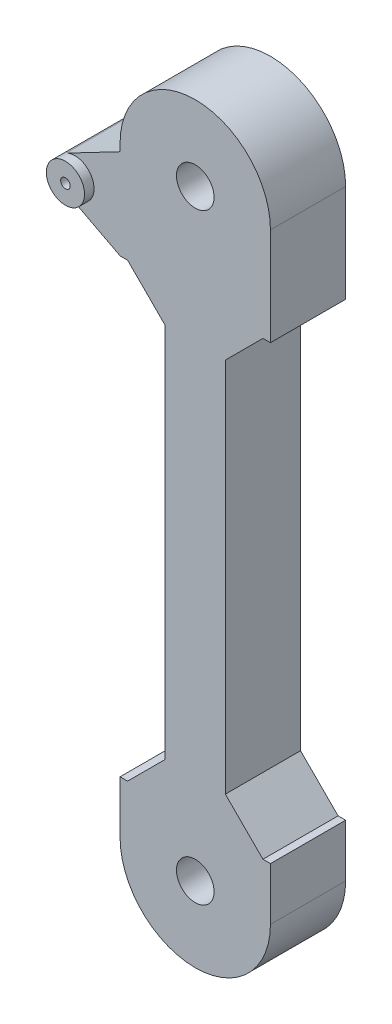
ISO-10303-21;
HEADER;
FILE_DESCRIPTION(('STEP AP214'),'2;1');
FILE_NAME('part.step','',(''),(''),'','','');
FILE_SCHEMA(('AUTOMOTIVE_DESIGN { 1 0 10303 214 1 1 1 1 }'));
ENDSEC;
DATA;
#1=APPLICATION_CONTEXT('core data for automotive mechanical design processes');
#2=APPLICATION_PROTOCOL_DEFINITION('international standard','automotive_design',2000,#1);
#3=PRODUCT_CONTEXT('',#1,'mechanical');
#4=PRODUCT('Part','Part','',(#3));
#5=PRODUCT_RELATED_PRODUCT_CATEGORY('part','',(#4));
#6=PRODUCT_DEFINITION_FORMATION('','',#4);
#7=PRODUCT_DEFINITION_CONTEXT('part definition',#1,'design');
#8=PRODUCT_DEFINITION('design','',#6,#7);
#9=PRODUCT_DEFINITION_SHAPE('','',#8);
#10=(LENGTH_UNIT() NAMED_UNIT(*) SI_UNIT(.MILLI.,.METRE.));
#11=(NAMED_UNIT(*) PLANE_ANGLE_UNIT() SI_UNIT($,.RADIAN.));
#12=(NAMED_UNIT(*) SI_UNIT($,.STERADIAN.) SOLID_ANGLE_UNIT());
#13=UNCERTAINTY_MEASURE_WITH_UNIT(LENGTH_MEASURE(1.E-05),#10,'distance_accuracy_value','');
#14=(GEOMETRIC_REPRESENTATION_CONTEXT(3) GLOBAL_UNCERTAINTY_ASSIGNED_CONTEXT((#13)) GLOBAL_UNIT_ASSIGNED_CONTEXT((#10,
#11,#12)) REPRESENTATION_CONTEXT('',''));
#15=CARTESIAN_POINT('',(0.,0.,0.));
#16=DIRECTION('',(0.,0.,1.));
#17=DIRECTION('',(1.,0.,0.));
#18=AXIS2_PLACEMENT_3D('',#15,#16,#17);
#19=CARTESIAN_POINT('',(10.,0.,10.));
#20=DIRECTION('',(-1.,0.,0.));
#21=DIRECTION('',(0.,-1.,0.));
#22=AXIS2_PLACEMENT_3D('',#19,#20,#21);
#23=PLANE('',#22);
#24=DIRECTION('',(0.,1.,0.));
#25=VECTOR('',#24,1.);
#26=CARTESIAN_POINT('',(10.,0.,0.));
#27=LINE('',#26,#25);
#28=CARTESIAN_POINT('',(10.,0.,0.));
#29=VERTEX_POINT('',#28);
#30=CARTESIAN_POINT('',(9.99999999999999,7.00000000000001,0.));
#31=VERTEX_POINT('',#30);
#32=EDGE_CURVE('E220',#29,#31,#27,.T.);
#33=ORIENTED_EDGE('',*,*,#32,.T.);
#34=DIRECTION('',(0.,0.,1.));
#35=VECTOR('',#34,1.);
#36=CARTESIAN_POINT('',(9.99999999999999,7.00000000000001,0.));
#37=LINE('',#36,#35);
#38=CARTESIAN_POINT('',(9.99999999999999,7.00000000000001,10.));
#39=VERTEX_POINT('',#38);
#40=EDGE_CURVE('E488',#31,#39,#37,.T.);
#41=ORIENTED_EDGE('',*,*,#40,.T.);
#42=DIRECTION('',(0.,1.,0.));
#43=VECTOR('',#42,1.);
#44=CARTESIAN_POINT('',(10.,0.,10.));
#45=LINE('',#44,#43);
#46=CARTESIAN_POINT('',(10.,0.,10.));
#47=VERTEX_POINT('',#46);
#48=EDGE_CURVE('E230',#47,#39,#45,.T.);
#49=ORIENTED_EDGE('',*,*,#48,.F.);
#50=DIRECTION('',(0.,0.,-1.));
#51=VECTOR('',#50,1.);
#52=CARTESIAN_POINT('',(10.,0.,10.));
#53=LINE('',#52,#51);
#54=EDGE_CURVE('E229',#47,#29,#53,.T.);
#55=ORIENTED_EDGE('',*,*,#54,.T.);
#56=EDGE_LOOP('',(#33,#41,#49,#55));
#57=FACE_BOUND('',#56,.T.);
#58=ADVANCED_FACE('F45',(#57),#23,.F.);
#59=CARTESIAN_POINT('',(-10.,80.,10.));
#60=DIRECTION('',(1.,0.,0.));
#61=DIRECTION('',(0.,1.,0.));
#62=AXIS2_PLACEMENT_3D('',#59,#60,#61);
#63=PLANE('',#62);
#64=DIRECTION('',(0.,-1.,0.));
#65=VECTOR('',#64,1.);
#66=CARTESIAN_POINT('',(-10.,80.,10.));
#67=LINE('',#66,#65);
#68=CARTESIAN_POINT('',(-9.99999999999999,7.00000000000001,10.));
#69=VERTEX_POINT('',#68);
#70=CARTESIAN_POINT('',(-10.,0.,10.));
#71=VERTEX_POINT('',#70);
#72=EDGE_CURVE('E197',#69,#71,#67,.T.);
#73=ORIENTED_EDGE('',*,*,#72,.F.);
#74=DIRECTION('',(0.,0.,1.));
#75=VECTOR('',#74,1.);
#76=CARTESIAN_POINT('',(-9.99999999999999,7.00000000000001,0.));
#77=LINE('',#76,#75);
#78=CARTESIAN_POINT('',(-9.99999999999999,7.00000000000001,0.));
#79=VERTEX_POINT('',#78);
#80=EDGE_CURVE('E180',#79,#69,#77,.T.);
#81=ORIENTED_EDGE('',*,*,#80,.F.);
#82=DIRECTION('',(0.,-1.,0.));
#83=VECTOR('',#82,1.);
#84=CARTESIAN_POINT('',(-10.,80.,0.));
#85=LINE('',#84,#83);
#86=CARTESIAN_POINT('',(-10.,0.,0.));
#87=VERTEX_POINT('',#86);
#88=EDGE_CURVE('E195',#79,#87,#85,.T.);
#89=ORIENTED_EDGE('',*,*,#88,.T.);
#90=DIRECTION('',(0.,0.,-1.));
#91=VECTOR('',#90,1.);
#92=CARTESIAN_POINT('',(-10.,0.,10.));
#93=LINE('',#92,#91);
#94=EDGE_CURVE('E234',#71,#87,#93,.T.);
#95=ORIENTED_EDGE('',*,*,#94,.F.);
#96=EDGE_LOOP('',(#73,#81,#89,#95));
#97=FACE_BOUND('',#96,.T.);
#98=ADVANCED_FACE('F193',(#97),#63,.F.);
#99=CARTESIAN_POINT('',(0.,80.,10.));
#100=DIRECTION('',(0.,0.,-1.));
#101=DIRECTION('',(-1.,0.,0.));
#102=AXIS2_PLACEMENT_3D('',#99,#100,#101);
#103=CYLINDRICAL_SURFACE('',#102,10.);
#104=CARTESIAN_POINT('',(0.,80.,0.));
#105=DIRECTION('',(0.,0.,1.));
#106=DIRECTION('',(1.,0.,0.));
#107=AXIS2_PLACEMENT_3D('',#104,#105,#106);
#108=CIRCLE('',#107,10.);
#109=CARTESIAN_POINT('',(10.,80.,0.));
#110=VERTEX_POINT('',#109);
#111=CARTESIAN_POINT('',(-10.,80.,0.));
#112=VERTEX_POINT('',#111);
#113=EDGE_CURVE('E208',#110,#112,#108,.T.);
#114=ORIENTED_EDGE('',*,*,#113,.T.);
#115=DIRECTION('',(0.,0.,-1.));
#116=VECTOR('',#115,1.);
#117=CARTESIAN_POINT('',(-10.,80.,10.));
#118=LINE('',#117,#116);
#119=CARTESIAN_POINT('',(-10.,80.,10.));
#120=VERTEX_POINT('',#119);
#121=EDGE_CURVE('E237',#120,#112,#118,.T.);
#122=ORIENTED_EDGE('',*,*,#121,.F.);
#123=CARTESIAN_POINT('',(0.,80.,10.));
#124=DIRECTION('',(0.,0.,1.));
#125=DIRECTION('',(1.,0.,0.));
#126=AXIS2_PLACEMENT_3D('',#123,#124,#125);
#127=CIRCLE('',#126,10.);
#128=CARTESIAN_POINT('',(10.,80.,10.));
#129=VERTEX_POINT('',#128);
#130=EDGE_CURVE('E224',#129,#120,#127,.T.);
#131=ORIENTED_EDGE('',*,*,#130,.F.);
#132=DIRECTION('',(0.,0.,-1.));
#133=VECTOR('',#132,1.);
#134=CARTESIAN_POINT('',(10.,80.,10.));
#135=LINE('',#134,#133);
#136=EDGE_CURVE('E225',#129,#110,#135,.T.);
#137=ORIENTED_EDGE('',*,*,#136,.T.);
#138=EDGE_LOOP('',(#114,#122,#131,#137));
#139=FACE_BOUND('',#138,.T.);
#140=ADVANCED_FACE('F315',(#139),#103,.T.);
#141=CARTESIAN_POINT('',(-10.,79.,0.));
#142=VERTEX_POINT('',#141);
#143=EDGE_CURVE('E207',#112,#142,#85,.T.);
#144=ORIENTED_EDGE('',*,*,#143,.T.);
#145=DIRECTION('',(0.,0.,1.));
#146=VECTOR('',#145,1.);
#147=CARTESIAN_POINT('',(-10.,79.,0.));
#148=LINE('',#147,#146);
#149=CARTESIAN_POINT('',(-10.,79.,10.));
#150=VERTEX_POINT('',#149);
#151=EDGE_CURVE('E324',#142,#150,#148,.T.);
#152=ORIENTED_EDGE('',*,*,#151,.T.);
#153=EDGE_CURVE('E296',#120,#150,#67,.T.);
#154=ORIENTED_EDGE('',*,*,#153,.F.);
#155=ORIENTED_EDGE('',*,*,#121,.T.);
#156=EDGE_LOOP('',(#144,#152,#154,#155));
#157=FACE_BOUND('',#156,.T.);
#158=ADVANCED_FACE('F323',(#157),#63,.F.);
#159=CARTESIAN_POINT('',(0.,0.,10.));
#160=DIRECTION('',(0.,0.,-1.));
#161=DIRECTION('',(-1.,0.,0.));
#162=AXIS2_PLACEMENT_3D('',#159,#160,#161);
#163=CYLINDRICAL_SURFACE('',#162,10.);
#164=CARTESIAN_POINT('',(0.,0.,0.));
#165=DIRECTION('',(0.,0.,1.));
#166=DIRECTION('',(1.,0.,0.));
#167=AXIS2_PLACEMENT_3D('',#164,#165,#166);
#168=CIRCLE('',#167,10.);
#169=EDGE_CURVE('E205',#87,#29,#168,.T.);
#170=ORIENTED_EDGE('',*,*,#169,.T.);
#171=ORIENTED_EDGE('',*,*,#54,.F.);
#172=CARTESIAN_POINT('',(0.,0.,10.));
#173=DIRECTION('',(0.,0.,1.));
#174=DIRECTION('',(1.,0.,0.));
#175=AXIS2_PLACEMENT_3D('',#172,#173,#174);
#176=CIRCLE('',#175,10.);
#177=EDGE_CURVE('E294',#71,#47,#176,.T.);
#178=ORIENTED_EDGE('',*,*,#177,.F.);
#179=ORIENTED_EDGE('',*,*,#94,.T.);
#180=EDGE_LOOP('',(#170,#171,#178,#179));
#181=FACE_BOUND('',#180,.T.);
#182=ADVANCED_FACE('F427',(#181),#163,.T.);
#183=CARTESIAN_POINT('',(10.,67.,10.));
#184=VERTEX_POINT('',#183);
#185=EDGE_CURVE('E292',#184,#129,#45,.T.);
#186=ORIENTED_EDGE('',*,*,#185,.F.);
#187=DIRECTION('',(0.,0.,1.));
#188=VECTOR('',#187,1.);
#189=CARTESIAN_POINT('',(10.,67.,0.));
#190=LINE('',#189,#188);
#191=CARTESIAN_POINT('',(10.,67.,0.));
#192=VERTEX_POINT('',#191);
#193=EDGE_CURVE('E312',#192,#184,#190,.T.);
#194=ORIENTED_EDGE('',*,*,#193,.F.);
#195=EDGE_CURVE('E219',#192,#110,#27,.T.);
#196=ORIENTED_EDGE('',*,*,#195,.T.);
#197=ORIENTED_EDGE('',*,*,#136,.F.);
#198=EDGE_LOOP('',(#186,#194,#196,#197));
#199=FACE_BOUND('',#198,.T.);
#200=ADVANCED_FACE('F310',(#199),#23,.F.);
#201=CARTESIAN_POINT('',(0.,80.,10.));
#202=DIRECTION('',(0.,0.,1.));
#203=DIRECTION('',(1.,0.,0.));
#204=AXIS2_PLACEMENT_3D('',#201,#202,#203);
#205=PLANE('',#204);
#206=DIRECTION('',(-1.,0.,0.));
#207=VECTOR('',#206,1.);
#208=CARTESIAN_POINT('',(-10.,67.,10.));
#209=LINE('',#208,#207);
#210=CARTESIAN_POINT('',(-9.00000000000006,67.,10.));
#211=VERTEX_POINT('',#210);
#212=CARTESIAN_POINT('',(-10.,67.,10.));
#213=VERTEX_POINT('',#212);
#214=EDGE_CURVE('E189',#211,#213,#209,.T.);
#215=ORIENTED_EDGE('',*,*,#214,.F.);
#216=DIRECTION('',(-0.707106781186552,0.707106781186543,0.));
#217=VECTOR('',#216,1.);
#218=CARTESIAN_POINT('',(-9.00000000000006,67.,10.));
#219=LINE('',#218,#217);
#220=CARTESIAN_POINT('',(-4.,62.,10.));
#221=VERTEX_POINT('',#220);
#222=EDGE_CURVE('E280',#211,#221,#219,.F.);
#223=ORIENTED_EDGE('',*,*,#222,.T.);
#224=DIRECTION('',(0.,1.,0.));
#225=VECTOR('',#224,1.);
#226=CARTESIAN_POINT('',(-4.,67.,10.));
#227=LINE('',#226,#225);
#228=CARTESIAN_POINT('',(-4.,12.,10.));
#229=VERTEX_POINT('',#228);
#230=EDGE_CURVE('E336',#229,#221,#227,.T.);
#231=ORIENTED_EDGE('',*,*,#230,.F.);
#232=DIRECTION('',(0.707106781186544,0.707106781186552,0.));
#233=VECTOR('',#232,1.);
#234=CARTESIAN_POINT('',(-4.,12.,10.));
#235=LINE('',#234,#233);
#236=CARTESIAN_POINT('',(-8.99999999999996,7.00000000000001,10.));
#237=VERTEX_POINT('',#236);
#238=EDGE_CURVE('E274',#229,#237,#235,.F.);
#239=ORIENTED_EDGE('',*,*,#238,.T.);
#240=DIRECTION('',(1.,0.,0.));
#241=VECTOR('',#240,1.);
#242=CARTESIAN_POINT('',(-9.99999999999999,7.00000000000001,10.));
#243=LINE('',#242,#241);
#244=EDGE_CURVE('E331',#69,#237,#243,.T.);
#245=ORIENTED_EDGE('',*,*,#244,.F.);
#246=ORIENTED_EDGE('',*,*,#72,.T.);
#247=ORIENTED_EDGE('',*,*,#177,.T.);
#248=ORIENTED_EDGE('',*,*,#48,.T.);
#249=DIRECTION('',(1.,0.,0.));
#250=VECTOR('',#249,1.);
#251=CARTESIAN_POINT('',(9.99999999999999,7.00000000000001,10.));
#252=LINE('',#251,#250);
#253=CARTESIAN_POINT('',(9.00000000000003,7.00000000000001,10.));
#254=VERTEX_POINT('',#253);
#255=EDGE_CURVE('E339',#254,#39,#252,.T.);
#256=ORIENTED_EDGE('',*,*,#255,.F.);
#257=DIRECTION('',(0.707106781186551,-0.707106781186544,0.));
#258=VECTOR('',#257,1.);
#259=CARTESIAN_POINT('',(9.00000000000003,7.00000000000001,10.));
#260=LINE('',#259,#258);
#261=CARTESIAN_POINT('',(4.,12.,10.));
#262=VERTEX_POINT('',#261);
#263=EDGE_CURVE('E268',#254,#262,#260,.F.);
#264=ORIENTED_EDGE('',*,*,#263,.T.);
#265=DIRECTION('',(0.,-1.,0.));
#266=VECTOR('',#265,1.);
#267=CARTESIAN_POINT('',(4.,67.,10.));
#268=LINE('',#267,#266);
#269=CARTESIAN_POINT('',(4.,61.9999999999999,10.));
#270=VERTEX_POINT('',#269);
#271=EDGE_CURVE('E332',#270,#262,#268,.T.);
#272=ORIENTED_EDGE('',*,*,#271,.F.);
#273=DIRECTION('',(-0.707106781186544,-0.707106781186551,0.));
#274=VECTOR('',#273,1.);
#275=CARTESIAN_POINT('',(4.,61.9999999999999,10.));
#276=LINE('',#275,#274);
#277=CARTESIAN_POINT('',(9.00000000000001,67.,10.));
#278=VERTEX_POINT('',#277);
#279=EDGE_CURVE('E55',#270,#278,#276,.F.);
#280=ORIENTED_EDGE('',*,*,#279,.T.);
#281=DIRECTION('',(-1.,0.,0.));
#282=VECTOR('',#281,1.);
#283=CARTESIAN_POINT('',(10.,67.,10.));
#284=LINE('',#283,#282);
#285=EDGE_CURVE('E329',#184,#278,#284,.T.);
#286=ORIENTED_EDGE('',*,*,#285,.F.);
#287=ORIENTED_EDGE('',*,*,#185,.T.);
#288=ORIENTED_EDGE('',*,*,#130,.T.);
#289=ORIENTED_EDGE('',*,*,#153,.T.);
#290=DIRECTION('',(-0.886349719827352,-0.463016386494014,0.));
#291=VECTOR('',#290,1.);
#292=CARTESIAN_POINT('',(-10.,79.,10.));
#293=LINE('',#292,#291);
#294=CARTESIAN_POINT('',(-17.1760616216948,75.2513282883615,10.));
#295=VERTEX_POINT('',#294);
#296=EDGE_CURVE('E364',#150,#295,#293,.T.);
#297=ORIENTED_EDGE('',*,*,#296,.T.);
#298=CARTESIAN_POINT('',(-16.,73.,10.));
#299=DIRECTION('',(0.,0.,1.));
#300=DIRECTION('',(1.,0.,0.));
#301=AXIS2_PLACEMENT_3D('',#298,#299,#300);
#302=CIRCLE('',#301,2.54);
#303=CARTESIAN_POINT('',(-17.1760616216954,70.7486717116388,10.));
#304=VERTEX_POINT('',#303);
#305=EDGE_CURVE('E241',#304,#295,#302,.T.);
#306=ORIENTED_EDGE('',*,*,#305,.F.);
#307=DIRECTION('',(0.886349719827354,-0.463016386494011,0.));
#308=VECTOR('',#307,1.);
#309=CARTESIAN_POINT('',(-17.1760616216954,70.7486717116388,10.));
#310=LINE('',#309,#308);
#311=EDGE_CURVE('E368',#304,#213,#310,.T.);
#312=ORIENTED_EDGE('',*,*,#311,.T.);
#313=EDGE_LOOP('',(#215,#223,#231,#239,#245,#246,#247,#248,#256,#264,#272,#280,#286,#287,#288,
#289,#297,#306,#312));
#314=FACE_BOUND('',#313,.T.);
#315=CARTESIAN_POINT('',(0.,0.,10.));
#316=DIRECTION('',(0.,0.,1.));
#317=DIRECTION('',(1.,0.,0.));
#318=AXIS2_PLACEMENT_3D('',#315,#316,#317);
#319=CIRCLE('',#318,2.5);
#320=CARTESIAN_POINT('',(2.5,0.,10.));
#321=VERTEX_POINT('',#320);
#322=EDGE_CURVE('E399',#321,#321,#319,.T.);
#323=ORIENTED_EDGE('',*,*,#322,.F.);
#324=EDGE_LOOP('',(#323));
#325=FACE_BOUND('',#324,.T.);
#326=CARTESIAN_POINT('',(0.,80.,10.));
#327=DIRECTION('',(0.,0.,1.));
#328=DIRECTION('',(1.,0.,0.));
#329=AXIS2_PLACEMENT_3D('',#326,#327,#328);
#330=CIRCLE('',#329,2.5);
#331=CARTESIAN_POINT('',(2.5,80.,10.));
#332=VERTEX_POINT('',#331);
#333=EDGE_CURVE('E403',#332,#332,#330,.T.);
#334=ORIENTED_EDGE('',*,*,#333,.F.);
#335=EDGE_LOOP('',(#334));
#336=FACE_BOUND('',#335,.T.);
#337=ADVANCED_FACE('F327',(#314,#325,#336),#205,.T.);
#338=CARTESIAN_POINT('',(0.,80.,0.));
#339=DIRECTION('',(0.,0.,1.));
#340=DIRECTION('',(1.,0.,0.));
#341=AXIS2_PLACEMENT_3D('',#338,#339,#340);
#342=PLANE('',#341);
#343=CARTESIAN_POINT('',(-16.,73.,0.));
#344=DIRECTION('',(0.,0.,1.));
#345=DIRECTION('',(1.,0.,0.));
#346=AXIS2_PLACEMENT_3D('',#343,#344,#345);
#347=CIRCLE('',#346,0.635000000000003);
#348=CARTESIAN_POINT('',(-15.365,73.,0.));
#349=VERTEX_POINT('',#348);
#350=EDGE_CURVE('E359',#349,#349,#347,.T.);
#351=ORIENTED_EDGE('',*,*,#350,.T.);
#352=EDGE_LOOP('',(#351));
#353=FACE_BOUND('',#352,.T.);
#354=CARTESIAN_POINT('',(0.,0.,0.));
#355=DIRECTION('',(0.,0.,1.));
#356=DIRECTION('',(1.,0.,0.));
#357=AXIS2_PLACEMENT_3D('',#354,#355,#356);
#358=CIRCLE('',#357,2.5);
#359=CARTESIAN_POINT('',(2.5,0.,0.));
#360=VERTEX_POINT('',#359);
#361=EDGE_CURVE('E213',#360,#360,#358,.T.);
#362=ORIENTED_EDGE('',*,*,#361,.T.);
#363=EDGE_LOOP('',(#362));
#364=FACE_BOUND('',#363,.T.);
#365=CARTESIAN_POINT('',(0.,80.,0.));
#366=DIRECTION('',(0.,0.,1.));
#367=DIRECTION('',(1.,0.,0.));
#368=AXIS2_PLACEMENT_3D('',#365,#366,#367);
#369=CIRCLE('',#368,2.5);
#370=CARTESIAN_POINT('',(2.5,80.,0.));
#371=VERTEX_POINT('',#370);
#372=EDGE_CURVE('E385',#371,#371,#369,.T.);
#373=ORIENTED_EDGE('',*,*,#372,.T.);
#374=EDGE_LOOP('',(#373));
#375=FACE_BOUND('',#374,.T.);
#376=DIRECTION('',(1.,0.,0.));
#377=VECTOR('',#376,1.);
#378=CARTESIAN_POINT('',(-9.99999999999999,7.00000000000001,0.));
#379=LINE('',#378,#377);
#380=CARTESIAN_POINT('',(-8.99999999999996,7.00000000000001,0.));
#381=VERTEX_POINT('',#380);
#382=EDGE_CURVE('E176',#79,#381,#379,.T.);
#383=ORIENTED_EDGE('',*,*,#382,.T.);
#384=DIRECTION('',(-0.707106781186544,-0.707106781186552,0.));
#385=VECTOR('',#384,1.);
#386=CARTESIAN_POINT('',(32.,48.0000000000004,0.));
#387=LINE('',#386,#385);
#388=CARTESIAN_POINT('',(-4.,12.,0.));
#389=VERTEX_POINT('',#388);
#390=EDGE_CURVE('E277',#381,#389,#387,.F.);
#391=ORIENTED_EDGE('',*,*,#390,.T.);
#392=DIRECTION('',(0.,1.,0.));
#393=VECTOR('',#392,1.);
#394=CARTESIAN_POINT('',(-4.,67.,0.));
#395=LINE('',#394,#393);
#396=CARTESIAN_POINT('',(-4.,62.,0.));
#397=VERTEX_POINT('',#396);
#398=EDGE_CURVE('E188',#389,#397,#395,.T.);
#399=ORIENTED_EDGE('',*,*,#398,.T.);
#400=DIRECTION('',(0.707106781186552,-0.707106781186543,0.));
#401=VECTOR('',#400,1.);
#402=CARTESIAN_POINT('',(-11.,68.9999999999999,0.));
#403=LINE('',#402,#401);
#404=CARTESIAN_POINT('',(-9.00000000000006,67.,0.));
#405=VERTEX_POINT('',#404);
#406=EDGE_CURVE('E283',#397,#405,#403,.F.);
#407=ORIENTED_EDGE('',*,*,#406,.T.);
#408=DIRECTION('',(-1.,0.,0.));
#409=VECTOR('',#408,1.);
#410=CARTESIAN_POINT('',(-10.,67.,0.));
#411=LINE('',#410,#409);
#412=CARTESIAN_POINT('',(-10.,67.,0.));
#413=VERTEX_POINT('',#412);
#414=EDGE_CURVE('E200',#405,#413,#411,.T.);
#415=ORIENTED_EDGE('',*,*,#414,.T.);
#416=DIRECTION('',(0.886349719827354,-0.463016386494011,0.));
#417=VECTOR('',#416,1.);
#418=CARTESIAN_POINT('',(-17.1760616216954,70.7486717116388,0.));
#419=LINE('',#418,#417);
#420=CARTESIAN_POINT('',(-17.1760616216954,70.7486717116388,0.));
#421=VERTEX_POINT('',#420);
#422=EDGE_CURVE('E372',#421,#413,#419,.T.);
#423=ORIENTED_EDGE('',*,*,#422,.F.);
#424=CARTESIAN_POINT('',(-16.,73.,0.));
#425=DIRECTION('',(0.,0.,1.));
#426=DIRECTION('',(1.,0.,0.));
#427=AXIS2_PLACEMENT_3D('',#424,#425,#426);
#428=CIRCLE('',#427,2.54000000000004);
#429=CARTESIAN_POINT('',(-17.1760616216954,75.2513282883612,0.));
#430=VERTEX_POINT('',#429);
#431=EDGE_CURVE('E367',#430,#421,#428,.T.);
#432=ORIENTED_EDGE('',*,*,#431,.F.);
#433=DIRECTION('',(-0.886349719827352,-0.463016386494014,0.));
#434=VECTOR('',#433,1.);
#435=CARTESIAN_POINT('',(-10.,79.,0.));
#436=LINE('',#435,#434);
#437=EDGE_CURVE('E320',#142,#430,#436,.T.);
#438=ORIENTED_EDGE('',*,*,#437,.F.);
#439=ORIENTED_EDGE('',*,*,#143,.F.);
#440=ORIENTED_EDGE('',*,*,#113,.F.);
#441=ORIENTED_EDGE('',*,*,#195,.F.);
#442=DIRECTION('',(-1.,0.,0.));
#443=VECTOR('',#442,1.);
#444=CARTESIAN_POINT('',(10.,67.,0.));
#445=LINE('',#444,#443);
#446=CARTESIAN_POINT('',(9.00000000000001,67.,0.));
#447=VERTEX_POINT('',#446);
#448=EDGE_CURVE('E350',#192,#447,#445,.T.);
#449=ORIENTED_EDGE('',*,*,#448,.T.);
#450=DIRECTION('',(0.707106781186544,0.707106781186551,0.));
#451=VECTOR('',#450,1.);
#452=CARTESIAN_POINT('',(11.0000000000001,69.0000000000001,0.));
#453=LINE('',#452,#451);
#454=CARTESIAN_POINT('',(4.,61.9999999999999,0.));
#455=VERTEX_POINT('',#454);
#456=EDGE_CURVE('E11',#447,#455,#453,.F.);
#457=ORIENTED_EDGE('',*,*,#456,.T.);
#458=DIRECTION('',(0.,-1.,0.));
#459=VECTOR('',#458,1.);
#460=CARTESIAN_POINT('',(4.,67.,0.));
#461=LINE('',#460,#459);
#462=CARTESIAN_POINT('',(4.,12.,0.));
#463=VERTEX_POINT('',#462);
#464=EDGE_CURVE('E346',#455,#463,#461,.T.);
#465=ORIENTED_EDGE('',*,*,#464,.T.);
#466=DIRECTION('',(-0.707106781186551,0.707106781186544,0.));
#467=VECTOR('',#466,1.);
#468=CARTESIAN_POINT('',(-32.,47.9999999999996,0.));
#469=LINE('',#468,#467);
#470=CARTESIAN_POINT('',(9.00000000000003,7.00000000000001,0.));
#471=VERTEX_POINT('',#470);
#472=EDGE_CURVE('E271',#463,#471,#469,.F.);
#473=ORIENTED_EDGE('',*,*,#472,.T.);
#474=DIRECTION('',(1.,0.,0.));
#475=VECTOR('',#474,1.);
#476=CARTESIAN_POINT('',(9.99999999999999,7.00000000000001,0.));
#477=LINE('',#476,#475);
#478=EDGE_CURVE('E343',#471,#31,#477,.T.);
#479=ORIENTED_EDGE('',*,*,#478,.T.);
#480=ORIENTED_EDGE('',*,*,#32,.F.);
#481=ORIENTED_EDGE('',*,*,#169,.F.);
#482=ORIENTED_EDGE('',*,*,#88,.F.);
#483=EDGE_LOOP('',(#383,#391,#399,#407,#415,#423,#432,#438,#439,#440,#441,#449,#457,#465,#473,
#479,#480,#481,#482));
#484=FACE_BOUND('',#483,.T.);
#485=ADVANCED_FACE('F203',(#353,#364,#375,#484),#342,.F.);
#486=CARTESIAN_POINT('',(0.,80.,0.));
#487=DIRECTION('',(0.,0.,1.));
#488=DIRECTION('',(1.,0.,0.));
#489=AXIS2_PLACEMENT_3D('',#486,#487,#488);
#490=CYLINDRICAL_SURFACE('',#489,2.5);
#491=ORIENTED_EDGE('',*,*,#372,.F.);
#492=EDGE_LOOP('',(#491));
#493=FACE_BOUND('',#492,.T.);
#494=ORIENTED_EDGE('',*,*,#333,.T.);
#495=EDGE_LOOP('',(#494));
#496=FACE_BOUND('',#495,.T.);
#497=ADVANCED_FACE('F412',(#493,#496),#490,.F.);
#498=CARTESIAN_POINT('',(0.,0.,0.));
#499=DIRECTION('',(0.,0.,1.));
#500=DIRECTION('',(1.,0.,0.));
#501=AXIS2_PLACEMENT_3D('',#498,#499,#500);
#502=CYLINDRICAL_SURFACE('',#501,2.5);
#503=ORIENTED_EDGE('',*,*,#361,.F.);
#504=EDGE_LOOP('',(#503));
#505=FACE_BOUND('',#504,.T.);
#506=ORIENTED_EDGE('',*,*,#322,.T.);
#507=EDGE_LOOP('',(#506));
#508=FACE_BOUND('',#507,.T.);
#509=ADVANCED_FACE('F415',(#505,#508),#502,.F.);
#510=CARTESIAN_POINT('',(-17.1760616216954,70.7486717116388,0.));
#511=DIRECTION('',(-0.463016386494011,-0.886349719827354,0.));
#512=DIRECTION('',(0.886349719827354,-0.463016386494011,0.));
#513=AXIS2_PLACEMENT_3D('',#510,#511,#512);
#514=PLANE('',#513);
#515=ORIENTED_EDGE('',*,*,#311,.F.);
#516=DIRECTION('',(0.,0.,1.));
#517=VECTOR('',#516,1.);
#518=CARTESIAN_POINT('',(-17.1760616216954,70.7486717116388,0.));
#519=LINE('',#518,#517);
#520=EDGE_CURVE('E386',#421,#304,#519,.T.);
#521=ORIENTED_EDGE('',*,*,#520,.F.);
#522=ORIENTED_EDGE('',*,*,#422,.T.);
#523=DIRECTION('',(0.,0.,1.));
#524=VECTOR('',#523,1.);
#525=CARTESIAN_POINT('',(-10.,67.,0.));
#526=LINE('',#525,#524);
#527=EDGE_CURVE('E381',#413,#213,#526,.T.);
#528=ORIENTED_EDGE('',*,*,#527,.T.);
#529=EDGE_LOOP('',(#515,#521,#522,#528));
#530=FACE_BOUND('',#529,.T.);
#531=ADVANCED_FACE('F528',(#530),#514,.T.);
#532=CARTESIAN_POINT('',(-16.,73.,0.));
#533=DIRECTION('',(0.,0.,1.));
#534=DIRECTION('',(1.,0.,0.));
#535=AXIS2_PLACEMENT_3D('',#532,#533,#534);
#536=CYLINDRICAL_SURFACE('',#535,2.54000000000004);
#537=ORIENTED_EDGE('',*,*,#520,.T.);
#538=ORIENTED_EDGE('',*,*,#305,.T.);
#539=DIRECTION('',(0.,0.,1.));
#540=VECTOR('',#539,1.);
#541=CARTESIAN_POINT('',(-17.1760616216954,75.2513282883612,0.));
#542=LINE('',#541,#540);
#543=EDGE_CURVE('E390',#430,#295,#542,.T.);
#544=ORIENTED_EDGE('',*,*,#543,.F.);
#545=ORIENTED_EDGE('',*,*,#431,.T.);
#546=EDGE_LOOP('',(#537,#538,#544,#545));
#547=FACE_BOUND('',#546,.T.);
#548=CARTESIAN_POINT('',(-16.,73.,11.27));
#549=DIRECTION('',(0.,0.,1.));
#550=DIRECTION('',(1.,0.,0.));
#551=AXIS2_PLACEMENT_3D('',#548,#549,#550);
#552=CIRCLE('',#551,2.54);
#553=CARTESIAN_POINT('',(-13.46,73.,11.27));
#554=VERTEX_POINT('',#553);
#555=EDGE_CURVE('E356',#554,#554,#552,.T.);
#556=ORIENTED_EDGE('',*,*,#555,.F.);
#557=EDGE_LOOP('',(#556));
#558=FACE_BOUND('',#557,.T.);
#559=ADVANCED_FACE('F531',(#547,#558),#536,.T.);
#560=CARTESIAN_POINT('',(-10.,79.,0.));
#561=DIRECTION('',(-0.463016386494014,0.886349719827352,0.));
#562=DIRECTION('',(-0.886349719827352,-0.463016386494014,0.));
#563=AXIS2_PLACEMENT_3D('',#560,#561,#562);
#564=PLANE('',#563);
#565=ORIENTED_EDGE('',*,*,#296,.F.);
#566=ORIENTED_EDGE('',*,*,#151,.F.);
#567=ORIENTED_EDGE('',*,*,#437,.T.);
#568=ORIENTED_EDGE('',*,*,#543,.T.);
#569=EDGE_LOOP('',(#565,#566,#567,#568));
#570=FACE_BOUND('',#569,.T.);
#571=ADVANCED_FACE('F526',(#570),#564,.T.);
#572=CARTESIAN_POINT('',(-16.,73.,0.));
#573=DIRECTION('',(0.,0.,1.));
#574=DIRECTION('',(1.,0.,0.));
#575=AXIS2_PLACEMENT_3D('',#572,#573,#574);
#576=CYLINDRICAL_SURFACE('',#575,0.635000000000003);
#577=ORIENTED_EDGE('',*,*,#350,.F.);
#578=EDGE_LOOP('',(#577));
#579=FACE_BOUND('',#578,.T.);
#580=CARTESIAN_POINT('',(-16.,73.,11.27));
#581=DIRECTION('',(0.,0.,1.));
#582=DIRECTION('',(1.,0.,0.));
#583=AXIS2_PLACEMENT_3D('',#580,#581,#582);
#584=CIRCLE('',#583,0.635000000000003);
#585=CARTESIAN_POINT('',(-15.365,73.,11.27));
#586=VERTEX_POINT('',#585);
#587=EDGE_CURVE('E199',#586,#586,#584,.T.);
#588=ORIENTED_EDGE('',*,*,#587,.T.);
#589=EDGE_LOOP('',(#588));
#590=FACE_BOUND('',#589,.T.);
#591=ADVANCED_FACE('F522',(#579,#590),#576,.F.);
#592=CARTESIAN_POINT('',(-16.,73.,11.27));
#593=DIRECTION('',(0.,0.,1.));
#594=DIRECTION('',(1.,0.,0.));
#595=AXIS2_PLACEMENT_3D('',#592,#593,#594);
#596=PLANE('',#595);
#597=ORIENTED_EDGE('',*,*,#555,.T.);
#598=EDGE_LOOP('',(#597));
#599=FACE_BOUND('',#598,.T.);
#600=ORIENTED_EDGE('',*,*,#587,.F.);
#601=EDGE_LOOP('',(#600));
#602=FACE_BOUND('',#601,.T.);
#603=ADVANCED_FACE('F519',(#599,#602),#596,.T.);
#604=CARTESIAN_POINT('',(-10.,67.,0.));
#605=DIRECTION('',(0.,1.,0.));
#606=DIRECTION('',(0.,0.,1.));
#607=AXIS2_PLACEMENT_3D('',#604,#605,#606);
#608=PLANE('',#607);
#609=ORIENTED_EDGE('',*,*,#414,.F.);
#610=DIRECTION('',(0.,0.,1.));
#611=VECTOR('',#610,1.);
#612=CARTESIAN_POINT('',(-9.00000000000006,67.,10.));
#613=LINE('',#612,#611);
#614=EDGE_CURVE('E262',#405,#211,#613,.T.);
#615=ORIENTED_EDGE('',*,*,#614,.T.);
#616=ORIENTED_EDGE('',*,*,#214,.T.);
#617=ORIENTED_EDGE('',*,*,#527,.F.);
#618=EDGE_LOOP('',(#609,#615,#616,#617));
#619=FACE_BOUND('',#618,.T.);
#620=ADVANCED_FACE('F475',(#619),#608,.F.);
#621=CARTESIAN_POINT('',(-4.,67.,0.));
#622=DIRECTION('',(1.,0.,0.));
#623=DIRECTION('',(0.,1.,0.));
#624=AXIS2_PLACEMENT_3D('',#621,#622,#623);
#625=PLANE('',#624);
#626=ORIENTED_EDGE('',*,*,#398,.F.);
#627=DIRECTION('',(0.,0.,1.));
#628=VECTOR('',#627,1.);
#629=CARTESIAN_POINT('',(-4.,12.,10.));
#630=LINE('',#629,#628);
#631=EDGE_CURVE('E256',#389,#229,#630,.T.);
#632=ORIENTED_EDGE('',*,*,#631,.T.);
#633=ORIENTED_EDGE('',*,*,#230,.T.);
#634=DIRECTION('',(0.,0.,-1.));
#635=VECTOR('',#634,1.);
#636=CARTESIAN_POINT('',(-4.,62.,0.));
#637=LINE('',#636,#635);
#638=EDGE_CURVE('E253',#221,#397,#637,.T.);
#639=ORIENTED_EDGE('',*,*,#638,.T.);
#640=EDGE_LOOP('',(#626,#632,#633,#639));
#641=FACE_BOUND('',#640,.T.);
#642=ADVANCED_FACE('F577',(#641),#625,.F.);
#643=CARTESIAN_POINT('',(-9.99999999999999,7.00000000000001,0.));
#644=DIRECTION('',(0.,-1.,0.));
#645=DIRECTION('',(0.,0.,-1.));
#646=AXIS2_PLACEMENT_3D('',#643,#644,#645);
#647=PLANE('',#646);
#648=ORIENTED_EDGE('',*,*,#244,.T.);
#649=DIRECTION('',(0.,0.,-1.));
#650=VECTOR('',#649,1.);
#651=CARTESIAN_POINT('',(-8.99999999999996,7.00000000000001,0.));
#652=LINE('',#651,#650);
#653=EDGE_CURVE('E183',#237,#381,#652,.T.);
#654=ORIENTED_EDGE('',*,*,#653,.T.);
#655=ORIENTED_EDGE('',*,*,#382,.F.);
#656=ORIENTED_EDGE('',*,*,#80,.T.);
#657=EDGE_LOOP('',(#648,#654,#655,#656));
#658=FACE_BOUND('',#657,.T.);
#659=ADVANCED_FACE('F179',(#658),#647,.F.);
#660=CARTESIAN_POINT('',(9.99999999999999,7.00000000000001,0.));
#661=DIRECTION('',(0.,-1.,0.));
#662=DIRECTION('',(0.,0.,-1.));
#663=AXIS2_PLACEMENT_3D('',#660,#661,#662);
#664=PLANE('',#663);
#665=ORIENTED_EDGE('',*,*,#478,.F.);
#666=DIRECTION('',(0.,0.,1.));
#667=VECTOR('',#666,1.);
#668=CARTESIAN_POINT('',(9.00000000000003,7.00000000000001,10.));
#669=LINE('',#668,#667);
#670=EDGE_CURVE('E242',#471,#254,#669,.T.);
#671=ORIENTED_EDGE('',*,*,#670,.T.);
#672=ORIENTED_EDGE('',*,*,#255,.T.);
#673=ORIENTED_EDGE('',*,*,#40,.F.);
#674=EDGE_LOOP('',(#665,#671,#672,#673));
#675=FACE_BOUND('',#674,.T.);
#676=ADVANCED_FACE('F496',(#675),#664,.F.);
#677=CARTESIAN_POINT('',(4.,67.,0.));
#678=DIRECTION('',(-1.,0.,0.));
#679=DIRECTION('',(0.,-1.,0.));
#680=AXIS2_PLACEMENT_3D('',#677,#678,#679);
#681=PLANE('',#680);
#682=ORIENTED_EDGE('',*,*,#271,.T.);
#683=DIRECTION('',(0.,0.,-1.));
#684=VECTOR('',#683,1.);
#685=CARTESIAN_POINT('',(4.,12.,0.));
#686=LINE('',#685,#684);
#687=EDGE_CURVE('E250',#262,#463,#686,.T.);
#688=ORIENTED_EDGE('',*,*,#687,.T.);
#689=ORIENTED_EDGE('',*,*,#464,.F.);
#690=DIRECTION('',(0.,0.,1.));
#691=VECTOR('',#690,1.);
#692=CARTESIAN_POINT('',(4.,61.9999999999999,10.));
#693=LINE('',#692,#691);
#694=EDGE_CURVE('E246',#455,#270,#693,.T.);
#695=ORIENTED_EDGE('',*,*,#694,.T.);
#696=EDGE_LOOP('',(#682,#688,#689,#695));
#697=FACE_BOUND('',#696,.T.);
#698=ADVANCED_FACE('F504',(#697),#681,.F.);
#699=CARTESIAN_POINT('',(10.,67.,0.));
#700=DIRECTION('',(0.,1.,0.));
#701=DIRECTION('',(0.,0.,1.));
#702=AXIS2_PLACEMENT_3D('',#699,#700,#701);
#703=PLANE('',#702);
#704=ORIENTED_EDGE('',*,*,#285,.T.);
#705=DIRECTION('',(0.,0.,-1.));
#706=VECTOR('',#705,1.);
#707=CARTESIAN_POINT('',(9.00000000000001,67.,0.));
#708=LINE('',#707,#706);
#709=EDGE_CURVE('E62',#278,#447,#708,.T.);
#710=ORIENTED_EDGE('',*,*,#709,.T.);
#711=ORIENTED_EDGE('',*,*,#448,.F.);
#712=ORIENTED_EDGE('',*,*,#193,.T.);
#713=EDGE_LOOP('',(#704,#710,#711,#712));
#714=FACE_BOUND('',#713,.T.);
#715=ADVANCED_FACE('F450',(#714),#703,.F.);
#716=CARTESIAN_POINT('',(9.00000000000003,7.00000000000001,0.));
#717=DIRECTION('',(0.707106781186544,0.707106781186551,0.));
#718=DIRECTION('',(0.,0.,-1.));
#719=AXIS2_PLACEMENT_3D('',#716,#717,#718);
#720=PLANE('',#719);
#721=ORIENTED_EDGE('',*,*,#472,.F.);
#722=ORIENTED_EDGE('',*,*,#687,.F.);
#723=ORIENTED_EDGE('',*,*,#263,.F.);
#724=ORIENTED_EDGE('',*,*,#670,.F.);
#725=EDGE_LOOP('',(#721,#722,#723,#724));
#726=FACE_BOUND('',#725,.T.);
#727=ADVANCED_FACE('F443',(#726),#720,.T.);
#728=CARTESIAN_POINT('',(-4.,12.,0.));
#729=DIRECTION('',(-0.707106781186552,0.707106781186544,0.));
#730=DIRECTION('',(0.,0.,-1.));
#731=AXIS2_PLACEMENT_3D('',#728,#729,#730);
#732=PLANE('',#731);
#733=ORIENTED_EDGE('',*,*,#390,.F.);
#734=ORIENTED_EDGE('',*,*,#653,.F.);
#735=ORIENTED_EDGE('',*,*,#238,.F.);
#736=ORIENTED_EDGE('',*,*,#631,.F.);
#737=EDGE_LOOP('',(#733,#734,#735,#736));
#738=FACE_BOUND('',#737,.T.);
#739=ADVANCED_FACE('F449',(#738),#732,.T.);
#740=CARTESIAN_POINT('',(-9.00000000000006,67.,0.));
#741=DIRECTION('',(-0.707106781186543,-0.707106781186552,0.));
#742=DIRECTION('',(0.,0.,-1.));
#743=AXIS2_PLACEMENT_3D('',#740,#741,#742);
#744=PLANE('',#743);
#745=ORIENTED_EDGE('',*,*,#406,.F.);
#746=ORIENTED_EDGE('',*,*,#638,.F.);
#747=ORIENTED_EDGE('',*,*,#222,.F.);
#748=ORIENTED_EDGE('',*,*,#614,.F.);
#749=EDGE_LOOP('',(#745,#746,#747,#748));
#750=FACE_BOUND('',#749,.T.);
#751=ADVANCED_FACE('F456',(#750),#744,.T.);
#752=CARTESIAN_POINT('',(4.,61.9999999999999,0.));
#753=DIRECTION('',(0.707106781186551,-0.707106781186544,0.));
#754=DIRECTION('',(0.,0.,-1.));
#755=AXIS2_PLACEMENT_3D('',#752,#753,#754);
#756=PLANE('',#755);
#757=ORIENTED_EDGE('',*,*,#456,.F.);
#758=ORIENTED_EDGE('',*,*,#709,.F.);
#759=ORIENTED_EDGE('',*,*,#279,.F.);
#760=ORIENTED_EDGE('',*,*,#694,.F.);
#761=EDGE_LOOP('',(#757,#758,#759,#760));
#762=FACE_BOUND('',#761,.T.);
#763=ADVANCED_FACE('F48',(#762),#756,.T.);
#764=CLOSED_SHELL('',(#58,#98,#140,#158,#182,#200,#337,#485,#497,#509,#531,#559,#571,#591,#603,
#620,#642,#659,#676,#698,#715,#727,#739,#751,#763));
#765=MANIFOLD_SOLID_BREP('B2',#764);
#766=ADVANCED_BREP_SHAPE_REPRESENTATION('',(#18,#765),#14);
#767=SHAPE_DEFINITION_REPRESENTATION(#9,#766);
ENDSEC;
END-ISO-10303-21;
